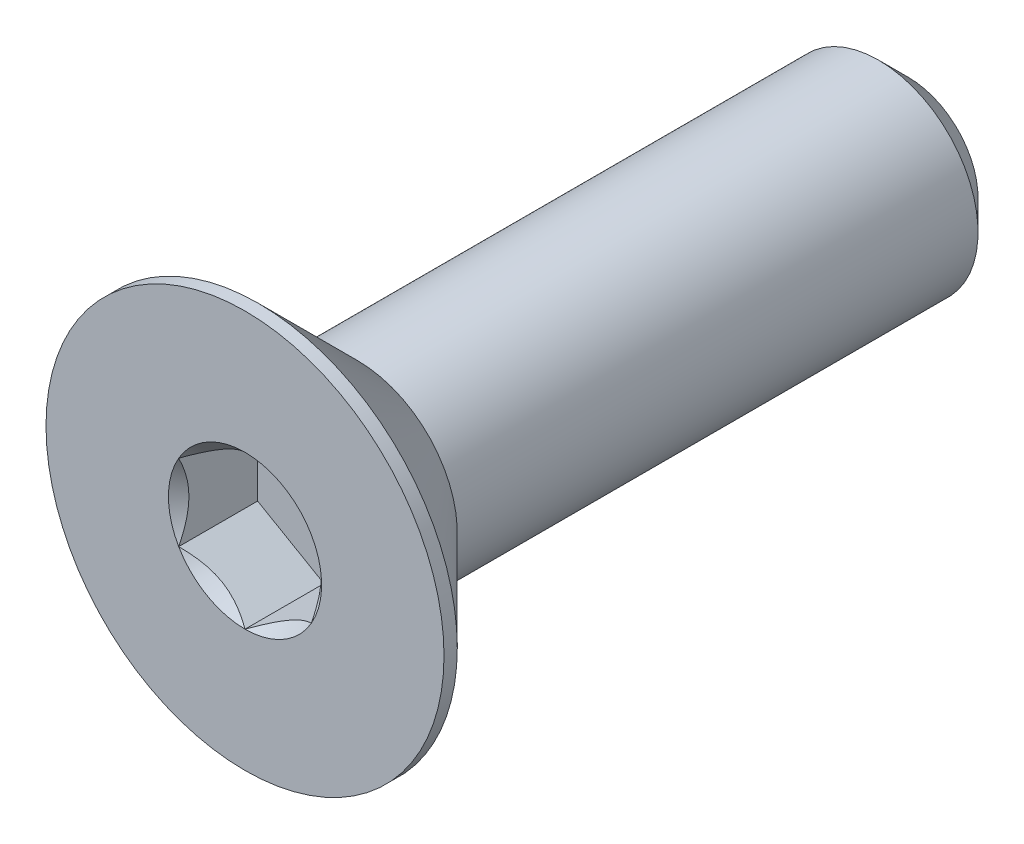
ISO-10303-21;
HEADER;
FILE_DESCRIPTION(('STEP AP214'),'2;1');
FILE_NAME('part.step','',(''),(''),'','','');
FILE_SCHEMA(('AUTOMOTIVE_DESIGN { 1 0 10303 214 1 1 1 1 }'));
ENDSEC;
DATA;
#1=APPLICATION_CONTEXT('core data for automotive mechanical design processes');
#2=APPLICATION_PROTOCOL_DEFINITION('international standard','automotive_design',2000,#1);
#3=PRODUCT_CONTEXT('',#1,'mechanical');
#4=PRODUCT('Part','Part','',(#3));
#5=PRODUCT_RELATED_PRODUCT_CATEGORY('part','',(#4));
#6=PRODUCT_DEFINITION_FORMATION('','',#4);
#7=PRODUCT_DEFINITION_CONTEXT('part definition',#1,'design');
#8=PRODUCT_DEFINITION('design','',#6,#7);
#9=PRODUCT_DEFINITION_SHAPE('','',#8);
#10=(LENGTH_UNIT() NAMED_UNIT(*) SI_UNIT(.MILLI.,.METRE.));
#11=(NAMED_UNIT(*) PLANE_ANGLE_UNIT() SI_UNIT($,.RADIAN.));
#12=(NAMED_UNIT(*) SI_UNIT($,.STERADIAN.) SOLID_ANGLE_UNIT());
#13=UNCERTAINTY_MEASURE_WITH_UNIT(LENGTH_MEASURE(1.E-05),#10,'distance_accuracy_value','');
#14=(GEOMETRIC_REPRESENTATION_CONTEXT(3) GLOBAL_UNCERTAINTY_ASSIGNED_CONTEXT((#13)) GLOBAL_UNIT_ASSIGNED_CONTEXT((#10,
#11,#12)) REPRESENTATION_CONTEXT('',''));
#15=CARTESIAN_POINT('',(0.,0.,0.));
#16=DIRECTION('',(0.,0.,1.));
#17=DIRECTION('',(1.,0.,0.));
#18=AXIS2_PLACEMENT_3D('',#15,#16,#17);
#19=CARTESIAN_POINT('',(0.,0.,-5.));
#20=DIRECTION('',(0.,0.,-1.));
#21=DIRECTION('',(0.,1.,0.));
#22=AXIS2_PLACEMENT_3D('',#19,#20,#21);
#23=CYLINDRICAL_SURFACE('',#22,1.5);
#24=CARTESIAN_POINT('',(0.,0.,3.3));
#25=DIRECTION('',(0.,0.,-1.));
#26=DIRECTION('',(0.,1.,0.));
#27=AXIS2_PLACEMENT_3D('',#24,#25,#26);
#28=CIRCLE('',#27,1.5);
#29=CARTESIAN_POINT('',(0.,1.5,3.3));
#30=VERTEX_POINT('',#29);
#31=EDGE_CURVE('E11',#30,#30,#28,.F.);
#32=ORIENTED_EDGE('',*,*,#31,.F.);
#33=EDGE_LOOP('',(#32));
#34=FACE_BOUND('',#33,.T.);
#35=CARTESIAN_POINT('',(0.,0.,-4.55));
#36=DIRECTION('',(0.,0.,-1.));
#37=DIRECTION('',(0.,1.,0.));
#38=AXIS2_PLACEMENT_3D('',#35,#36,#37);
#39=CIRCLE('',#38,1.5);
#40=CARTESIAN_POINT('',(0.,1.5,-4.55));
#41=VERTEX_POINT('',#40);
#42=EDGE_CURVE('E47',#41,#41,#39,.F.);
#43=ORIENTED_EDGE('',*,*,#42,.T.);
#44=EDGE_LOOP('',(#43));
#45=FACE_BOUND('',#44,.T.);
#46=ADVANCED_FACE('F39',(#34,#45),#23,.T.);
#47=CARTESIAN_POINT('',(0.,1.5,-5.));
#48=DIRECTION('',(0.,0.,-1.));
#49=DIRECTION('',(0.,1.,0.));
#50=AXIS2_PLACEMENT_3D('',#47,#48,#49);
#51=PLANE('',#50);
#52=CARTESIAN_POINT('',(0.,0.,-5.));
#53=DIRECTION('',(0.,0.,-1.));
#54=DIRECTION('',(0.,1.,0.));
#55=AXIS2_PLACEMENT_3D('',#52,#53,#54);
#56=CIRCLE('',#55,1.05);
#57=CARTESIAN_POINT('',(0.,1.05,-5.));
#58=VERTEX_POINT('',#57);
#59=EDGE_CURVE('E151',#58,#58,#56,.T.);
#60=ORIENTED_EDGE('',*,*,#59,.T.);
#61=EDGE_LOOP('',(#60));
#62=FACE_BOUND('',#61,.T.);
#63=ADVANCED_FACE('F160',(#62),#51,.T.);
#64=CARTESIAN_POINT('',(0.,0.,-5.));
#65=DIRECTION('',(0.,0.,1.));
#66=DIRECTION('',(0.,-1.,0.));
#67=AXIS2_PLACEMENT_3D('',#64,#65,#66);
#68=CONICAL_SURFACE('',#67,1.05,0.785398163397449);
#69=ORIENTED_EDGE('',*,*,#42,.F.);
#70=EDGE_LOOP('',(#69));
#71=FACE_BOUND('',#70,.T.);
#72=ORIENTED_EDGE('',*,*,#59,.F.);
#73=EDGE_LOOP('',(#72));
#74=FACE_BOUND('',#73,.T.);
#75=ADVANCED_FACE('F41',(#71,#74),#68,.T.);
#76=CARTESIAN_POINT('',(0.,0.,-5.));
#77=DIRECTION('',(0.,0.,-1.));
#78=DIRECTION('',(0.,1.,0.));
#79=AXIS2_PLACEMENT_3D('',#76,#77,#78);
#80=CYLINDRICAL_SURFACE('',#79,3.);
#81=CARTESIAN_POINT('',(0.,0.,5.));
#82=DIRECTION('',(0.,0.,-1.));
#83=DIRECTION('',(0.,1.,0.));
#84=AXIS2_PLACEMENT_3D('',#81,#82,#83);
#85=CIRCLE('',#84,3.);
#86=CARTESIAN_POINT('',(0.,3.,5.));
#87=VERTEX_POINT('',#86);
#88=EDGE_CURVE('E131',#87,#87,#85,.T.);
#89=ORIENTED_EDGE('',*,*,#88,.T.);
#90=EDGE_LOOP('',(#89));
#91=FACE_BOUND('',#90,.T.);
#92=CARTESIAN_POINT('',(0.,0.,4.8));
#93=DIRECTION('',(0.,0.,-1.));
#94=DIRECTION('',(0.,1.,0.));
#95=AXIS2_PLACEMENT_3D('',#92,#93,#94);
#96=CIRCLE('',#95,3.);
#97=CARTESIAN_POINT('',(0.,3.,4.8));
#98=VERTEX_POINT('',#97);
#99=EDGE_CURVE('E128',#98,#98,#96,.T.);
#100=ORIENTED_EDGE('',*,*,#99,.F.);
#101=EDGE_LOOP('',(#100));
#102=FACE_BOUND('',#101,.T.);
#103=ADVANCED_FACE('F159',(#91,#102),#80,.T.);
#104=CARTESIAN_POINT('',(0.,0.,3.3));
#105=DIRECTION('',(0.,0.,1.));
#106=DIRECTION('',(0.,-1.,0.));
#107=AXIS2_PLACEMENT_3D('',#104,#105,#106);
#108=CONICAL_SURFACE('',#107,1.5,0.78539816339745);
#109=ORIENTED_EDGE('',*,*,#99,.T.);
#110=EDGE_LOOP('',(#109));
#111=FACE_BOUND('',#110,.T.);
#112=ORIENTED_EDGE('',*,*,#31,.T.);
#113=EDGE_LOOP('',(#112));
#114=FACE_BOUND('',#113,.T.);
#115=ADVANCED_FACE('F173',(#111,#114),#108,.T.);
#116=CARTESIAN_POINT('',(0.,0.,5.));
#117=DIRECTION('',(0.,0.,1.));
#118=DIRECTION('',(0.,-1.,0.));
#119=AXIS2_PLACEMENT_3D('',#116,#117,#118);
#120=PLANE('',#119);
#121=CARTESIAN_POINT('',(0.,0.,5.));
#122=DIRECTION('',(0.,0.,1.));
#123=DIRECTION('',(1.,0.,0.));
#124=AXIS2_PLACEMENT_3D('',#121,#122,#123);
#125=CIRCLE('',#124,1.15470053837925);
#126=CARTESIAN_POINT('',(1.,0.577350269189632,5.));
#127=VERTEX_POINT('',#126);
#128=CARTESIAN_POINT('',(0.,1.15470053837926,5.));
#129=VERTEX_POINT('',#128);
#130=EDGE_CURVE('E98',#127,#129,#125,.T.);
#131=ORIENTED_EDGE('',*,*,#130,.F.);
#132=CARTESIAN_POINT('',(0.,0.,5.));
#133=DIRECTION('',(0.,0.,1.));
#134=DIRECTION('',(1.,0.,0.));
#135=AXIS2_PLACEMENT_3D('',#132,#133,#134);
#136=CIRCLE('',#135,1.15470053837925);
#137=CARTESIAN_POINT('',(0.999999999999989,-0.577350269189633,5.));
#138=VERTEX_POINT('',#137);
#139=EDGE_CURVE('E110',#138,#127,#136,.T.);
#140=ORIENTED_EDGE('',*,*,#139,.F.);
#141=CARTESIAN_POINT('',(0.,0.,5.));
#142=DIRECTION('',(0.,0.,1.));
#143=DIRECTION('',(1.,0.,0.));
#144=AXIS2_PLACEMENT_3D('',#141,#142,#143);
#145=CIRCLE('',#144,1.15470053837925);
#146=CARTESIAN_POINT('',(0.,-1.15470053837924,5.));
#147=VERTEX_POINT('',#146);
#148=EDGE_CURVE('E244',#147,#138,#145,.T.);
#149=ORIENTED_EDGE('',*,*,#148,.F.);
#150=CARTESIAN_POINT('',(0.,0.,5.));
#151=DIRECTION('',(0.,0.,1.));
#152=DIRECTION('',(1.,0.,0.));
#153=AXIS2_PLACEMENT_3D('',#150,#151,#152);
#154=CIRCLE('',#153,1.15470053837925);
#155=CARTESIAN_POINT('',(-1.,-0.577350269189614,5.));
#156=VERTEX_POINT('',#155);
#157=EDGE_CURVE('E123',#156,#147,#154,.T.);
#158=ORIENTED_EDGE('',*,*,#157,.F.);
#159=CARTESIAN_POINT('',(0.,0.,5.));
#160=DIRECTION('',(0.,0.,1.));
#161=DIRECTION('',(1.,0.,0.));
#162=AXIS2_PLACEMENT_3D('',#159,#160,#161);
#163=CIRCLE('',#162,1.15470053837925);
#164=CARTESIAN_POINT('',(-1.,0.577350269189624,5.));
#165=VERTEX_POINT('',#164);
#166=EDGE_CURVE('E245',#165,#156,#163,.T.);
#167=ORIENTED_EDGE('',*,*,#166,.F.);
#168=CARTESIAN_POINT('',(0.,0.,5.));
#169=DIRECTION('',(0.,0.,1.));
#170=DIRECTION('',(1.,0.,0.));
#171=AXIS2_PLACEMENT_3D('',#168,#169,#170);
#172=CIRCLE('',#171,1.15470053837925);
#173=EDGE_CURVE('E113',#129,#165,#172,.T.);
#174=ORIENTED_EDGE('',*,*,#173,.F.);
#175=EDGE_LOOP('',(#131,#140,#149,#158,#167,#174));
#176=FACE_BOUND('',#175,.T.);
#177=ORIENTED_EDGE('',*,*,#88,.F.);
#178=EDGE_LOOP('',(#177));
#179=FACE_BOUND('',#178,.T.);
#180=ADVANCED_FACE('F107',(#176,#179),#120,.T.);
#181=CARTESIAN_POINT('',(1.,0.577350269189626,3.81));
#182=DIRECTION('',(0.5,0.866025403784438,0.));
#183=DIRECTION('',(-0.866025403784439,0.5,0.));
#184=AXIS2_PLACEMENT_3D('',#181,#182,#183);
#185=PLANE('',#184);
#186=DIRECTION('',(0.,0.,1.));
#187=VECTOR('',#186,1.);
#188=CARTESIAN_POINT('',(1.,0.577350269189626,3.81));
#189=LINE('',#188,#187);
#190=CARTESIAN_POINT('',(1.,0.577350269189626,3.81));
#191=VERTEX_POINT('',#190);
#192=EDGE_CURVE('E54',#191,#127,#189,.T.);
#193=ORIENTED_EDGE('',*,*,#192,.T.);
#194=CARTESIAN_POINT('',(-0.000199999999999858,1.15481600843309,5.00011548737261));
#195=CARTESIAN_POINT('',(0.0341825950071805,1.13496520795026,4.98027793082573));
#196=CARTESIAN_POINT('',(0.0691401181398244,1.11478247255942,4.96160502063888));
#197=CARTESIAN_POINT('',(0.140422802956089,1.07362739529219,4.92741474272315));
#198=CARTESIAN_POINT('',(0.176754750528983,1.0526511355808,4.91191640902345));
#199=CARTESIAN_POINT('',(0.25001661380331,1.01035337909803,4.88536730714226));
#200=CARTESIAN_POINT('',(0.286927851445413,0.989042666109242,4.87424977399692));
#201=CARTESIAN_POINT('',(0.361562729310857,0.945952199282693,4.85711986577618));
#202=CARTESIAN_POINT('',(0.399284088108633,0.924173762626598,4.85109469746667));
#203=CARTESIAN_POINT('',(0.464292198417931,0.886641312640017,4.84566055496749));
#204=CARTESIAN_POINT('',(0.491494371528169,0.870936130672278,4.84485693831673));
#205=CARTESIAN_POINT('',(0.545846040669109,0.839556179862851,4.84620669941688));
#206=CARTESIAN_POINT('',(0.572995523754872,0.823881418494926,4.84836072954719));
#207=CARTESIAN_POINT('',(0.654056277326956,0.77708097059937,4.85911697212847));
#208=CARTESIAN_POINT('',(0.707564140978423,0.746188191116433,4.87201455641535));
#209=CARTESIAN_POINT('',(0.801476065143427,0.691968116419652,4.90314073060217));
#210=CARTESIAN_POINT('',(0.842320523671831,0.668386557293374,4.91973779770184));
#211=CARTESIAN_POINT('',(0.922409637381942,0.622147085933683,4.95712492468529));
#212=CARTESIAN_POINT('',(0.961659010870436,0.599486449584576,4.9779013418174));
#213=CARTESIAN_POINT('',(1.0002,0.577234799135789,5.00011548737261));
#214=B_SPLINE_CURVE_WITH_KNOTS('',3,(#194,#195,#196,#197,#198,#199,#200,#201,#202,#203,#204,
#205,#206,#207,#208,#209,#210,#211,#212,#213),.UNSPECIFIED.,.F.,.F.,(4,2,2,2,2,2,2,2,2,4),(0.,
0.133237676828558,0.267252229834488,0.399137076269297,0.530689603280765,0.624814864263842,
0.718960890149128,0.907306626112091,1.05710100361789,1.20641411519286),.UNSPECIFIED.);
#215=EDGE_CURVE('E95',#129,#127,#214,.T.);
#216=ORIENTED_EDGE('',*,*,#215,.F.);
#217=DIRECTION('',(0.,0.,1.));
#218=VECTOR('',#217,1.);
#219=CARTESIAN_POINT('',(0.,1.15470053837925,3.81));
#220=LINE('',#219,#218);
#221=CARTESIAN_POINT('',(0.,1.15470053837925,3.81));
#222=VERTEX_POINT('',#221);
#223=EDGE_CURVE('E147',#222,#129,#220,.T.);
#224=ORIENTED_EDGE('',*,*,#223,.F.);
#225=DIRECTION('',(-0.866025403784439,0.5,0.));
#226=VECTOR('',#225,1.);
#227=CARTESIAN_POINT('',(1.,0.577350269189626,3.81));
#228=LINE('',#227,#226);
#229=EDGE_CURVE('E120',#191,#222,#228,.T.);
#230=ORIENTED_EDGE('',*,*,#229,.F.);
#231=EDGE_LOOP('',(#193,#216,#224,#230));
#232=FACE_BOUND('',#231,.T.);
#233=ADVANCED_FACE('F125',(#232),#185,.F.);
#234=CARTESIAN_POINT('',(1.,-0.577350269189627,3.81));
#235=DIRECTION('',(1.,0.,0.));
#236=DIRECTION('',(0.,0.,-1.));
#237=AXIS2_PLACEMENT_3D('',#234,#235,#236);
#238=PLANE('',#237);
#239=DIRECTION('',(0.,0.,1.));
#240=VECTOR('',#239,1.);
#241=CARTESIAN_POINT('',(1.,-0.577350269189627,3.81));
#242=LINE('',#241,#240);
#243=CARTESIAN_POINT('',(1.,-0.577350269189627,3.81));
#244=VERTEX_POINT('',#243);
#245=EDGE_CURVE('E62',#244,#138,#242,.T.);
#246=ORIENTED_EDGE('',*,*,#245,.T.);
#247=CARTESIAN_POINT('',(1.,-1.15147208646462,5.37038567751388));
#248=CARTESIAN_POINT('',(1.,-1.12343447988553,5.34921991987373));
#249=CARTESIAN_POINT('',(1.,-1.09524064850698,5.32826169217592));
#250=CARTESIAN_POINT('',(1.,-1.03847715644377,5.28684602223563));
#251=CARTESIAN_POINT('',(1.,-1.00990740382976,5.26638870612367));
#252=CARTESIAN_POINT('',(1.,-0.923120894333482,5.20560479495452));
#253=CARTESIAN_POINT('',(1.,-0.864253173759064,5.16619222896141));
#254=CARTESIAN_POINT('',(1.,-0.740809858258048,5.08882066420021));
#255=CARTESIAN_POINT('',(1.,-0.676100255137809,5.05107303911435));
#256=CARTESIAN_POINT('',(1.,-0.543448939049125,4.9820245875513));
#257=CARTESIAN_POINT('',(1.,-0.475519112027778,4.95070202784687));
#258=CARTESIAN_POINT('',(1.,-0.373555850333527,4.9123817788838));
#259=CARTESIAN_POINT('',(1.,-0.341031989670906,4.90138359164216));
#260=CARTESIAN_POINT('',(1.,-0.275199079052291,4.88199834214736));
#261=CARTESIAN_POINT('',(1.,-0.24188997517393,4.8736114597767));
#262=CARTESIAN_POINT('',(1.,-0.175247517042989,4.86002522071902));
#263=CARTESIAN_POINT('',(1.,-0.141925568218171,4.85477079076797));
#264=CARTESIAN_POINT('',(1.,-0.0749144362322749,4.84754868657089));
#265=CARTESIAN_POINT('',(1.,-0.0412251978501574,4.84558151361051));
#266=CARTESIAN_POINT('',(1.,0.0249580992634259,4.84508319839316));
#267=CARTESIAN_POINT('',(1.,0.0574512826460445,4.84643026788864));
#268=CARTESIAN_POINT('',(1.,0.122148505701872,4.85221648449899));
#269=CARTESIAN_POINT('',(1.,0.154352610132932,4.85665492066154));
#270=CARTESIAN_POINT('',(1.,0.218799898867646,4.86845683014521));
#271=CARTESIAN_POINT('',(1.,0.25103374326896,4.87587054103851));
#272=CARTESIAN_POINT('',(1.,0.314797132354926,4.89322894249868));
#273=CARTESIAN_POINT('',(1.,0.346326735731012,4.90317342128883));
#274=CARTESIAN_POINT('',(1.,0.445594187730212,4.93822348255434));
#275=CARTESIAN_POINT('',(1.,0.511919139476043,4.96732085835673));
#276=CARTESIAN_POINT('',(1.,0.641453244657538,5.0320153296865));
#277=CARTESIAN_POINT('',(1.,0.70465013312635,5.06763577671524));
#278=CARTESIAN_POINT('',(1.,0.825428490174992,5.14112390134694));
#279=CARTESIAN_POINT('',(1.,0.88313294786769,5.17879194713546));
#280=CARTESIAN_POINT('',(1.,0.96814885370457,5.23702285294316));
#281=CARTESIAN_POINT('',(1.,0.99612057038029,5.25663847576286));
#282=CARTESIAN_POINT('',(1.,1.05168177729902,5.29638851706127));
#283=CARTESIAN_POINT('',(1.,1.07927136997701,5.31652279219883));
#284=CARTESIAN_POINT('',(1.,1.1067018534633,5.33687211907297));
#285=B_SPLINE_CURVE_WITH_KNOTS('',3,(#247,#248,#249,#250,#251,#252,#253,#254,#255,#256,#257,
#258,#259,#260,#261,#262,#263,#264,#265,#266,#267,#268,#269,#270,#271,#272,#273,#274,#275,#276,
#277,#278,#279,#280,#281,#282,#283,#284),.UNSPECIFIED.,.F.,.F.,(4,2,2,2,2,2,2,2,2,2,2,2,2,2,2,2,
2,2,4),(0.,0.105386459083292,0.210799187330128,0.423233611565475,0.647793540908513,
0.871580877738622,0.974493074181434,1.07741235827203,1.17846428203206,1.27953161415764,
1.37694086739612,1.4743277258541,1.57343322804295,1.67253043972853,1.88917353996829,
2.10660791038815,2.31323734249845,2.41572589232046,2.51818641476505),.UNSPECIFIED.);
#286=EDGE_CURVE('E119',#127,#138,#285,.F.);
#287=ORIENTED_EDGE('',*,*,#286,.F.);
#288=ORIENTED_EDGE('',*,*,#192,.F.);
#289=DIRECTION('',(0.,1.,0.));
#290=VECTOR('',#289,1.);
#291=CARTESIAN_POINT('',(1.,-0.577350269189627,3.81));
#292=LINE('',#291,#290);
#293=EDGE_CURVE('E136',#244,#191,#292,.T.);
#294=ORIENTED_EDGE('',*,*,#293,.F.);
#295=EDGE_LOOP('',(#246,#287,#288,#294));
#296=FACE_BOUND('',#295,.T.);
#297=ADVANCED_FACE('F122',(#296),#238,.F.);
#298=CARTESIAN_POINT('',(0.,-1.15470053837925,3.81));
#299=DIRECTION('',(0.5,-0.866025403784439,0.));
#300=DIRECTION('',(0.866025403784439,0.5,0.));
#301=AXIS2_PLACEMENT_3D('',#298,#299,#300);
#302=PLANE('',#301);
#303=DIRECTION('',(0.,0.,1.));
#304=VECTOR('',#303,1.);
#305=CARTESIAN_POINT('',(0.,-1.15470053837925,3.81));
#306=LINE('',#305,#304);
#307=CARTESIAN_POINT('',(0.,-1.15470053837925,3.81));
#308=VERTEX_POINT('',#307);
#309=EDGE_CURVE('E133',#308,#147,#306,.T.);
#310=ORIENTED_EDGE('',*,*,#309,.T.);
#311=CARTESIAN_POINT('',(1.0002,-0.577234799135789,5.00011548737262));
#312=CARTESIAN_POINT('',(0.965817404992819,-0.597085599618622,4.98027793082574));
#313=CARTESIAN_POINT('',(0.930859881860175,-0.617268335009457,4.9616050206389));
#314=CARTESIAN_POINT('',(0.859577197043911,-0.658423412276686,4.92741474272317));
#315=CARTESIAN_POINT('',(0.823245249471016,-0.67939967198808,4.91191640902347));
#316=CARTESIAN_POINT('',(0.74998338619669,-0.721697428470846,4.88536730714227));
#317=CARTESIAN_POINT('',(0.713072148554587,-0.743008141459637,4.87424977399694));
#318=CARTESIAN_POINT('',(0.638437270689143,-0.786098608286186,4.85711986577619));
#319=CARTESIAN_POINT('',(0.600715911891366,-0.80787704494228,4.85109469746668));
#320=CARTESIAN_POINT('',(0.535707801582069,-0.845409494928862,4.8456605549675));
#321=CARTESIAN_POINT('',(0.50850562847183,-0.861114676896601,4.84485693831674));
#322=CARTESIAN_POINT('',(0.45415395933089,-0.892494627706028,4.8462066994169));
#323=CARTESIAN_POINT('',(0.427004476245126,-0.908169389073953,4.84836072954721));
#324=CARTESIAN_POINT('',(0.345943722673041,-0.95496983696951,4.85911697212848));
#325=CARTESIAN_POINT('',(0.292435859021573,-0.985862616452447,4.87201455641537));
#326=CARTESIAN_POINT('',(0.198523934856569,-1.04008269114923,4.90314073060219));
#327=CARTESIAN_POINT('',(0.157679476328166,-1.06366425027551,4.91973779770185));
#328=CARTESIAN_POINT('',(0.0775903626180565,-1.1099037216352,4.9571249246853));
#329=CARTESIAN_POINT('',(0.0383409891295622,-1.1325643579843,4.97790134181741));
#330=CARTESIAN_POINT('',(-0.00020000000000016,-1.15481600843309,5.00011548737263));
#331=B_SPLINE_CURVE_WITH_KNOTS('',3,(#311,#312,#313,#314,#315,#316,#317,#318,#319,#320,#321,
#322,#323,#324,#325,#326,#327,#328,#329,#330),.UNSPECIFIED.,.F.,.F.,(4,2,2,2,2,2,2,2,2,4),(0.,
0.133237676828558,0.267252229834488,0.399137076269297,0.530689603280764,0.624814864263842,
0.71896089014913,0.907306626112095,1.05710100361789,1.20641411519286),.UNSPECIFIED.);
#332=EDGE_CURVE('E242',#138,#147,#331,.T.);
#333=ORIENTED_EDGE('',*,*,#332,.F.);
#334=ORIENTED_EDGE('',*,*,#245,.F.);
#335=DIRECTION('',(0.866025403784439,0.5,0.));
#336=VECTOR('',#335,1.);
#337=CARTESIAN_POINT('',(0.,-1.15470053837925,3.81));
#338=LINE('',#337,#336);
#339=EDGE_CURVE('E234',#308,#244,#338,.T.);
#340=ORIENTED_EDGE('',*,*,#339,.F.);
#341=EDGE_LOOP('',(#310,#333,#334,#340));
#342=FACE_BOUND('',#341,.T.);
#343=ADVANCED_FACE('F199',(#342),#302,.F.);
#344=CARTESIAN_POINT('',(-1.,-0.577350269189626,3.81));
#345=DIRECTION('',(-0.5,-0.866025403784439,0.));
#346=DIRECTION('',(0.866025403784439,-0.5,0.));
#347=AXIS2_PLACEMENT_3D('',#344,#345,#346);
#348=PLANE('',#347);
#349=DIRECTION('',(0.,0.,1.));
#350=VECTOR('',#349,1.);
#351=CARTESIAN_POINT('',(-1.,-0.577350269189626,3.81));
#352=LINE('',#351,#350);
#353=CARTESIAN_POINT('',(-1.,-0.577350269189626,3.81));
#354=VERTEX_POINT('',#353);
#355=EDGE_CURVE('E141',#354,#156,#352,.T.);
#356=ORIENTED_EDGE('',*,*,#355,.T.);
#357=CARTESIAN_POINT('',(0.000199999999999887,-1.15481600843309,5.00011548737263));
#358=CARTESIAN_POINT('',(-0.0341825950071811,-1.13496520795026,4.98027793082574));
#359=CARTESIAN_POINT('',(-0.0691401181398256,-1.11478247255942,4.9616050206389));
#360=CARTESIAN_POINT('',(-0.140422802956091,-1.07362739529219,4.92741474272317));
#361=CARTESIAN_POINT('',(-0.176754750528986,-1.0526511355808,4.91191640902347));
#362=CARTESIAN_POINT('',(-0.250016613803313,-1.01035337909803,4.88536730714228));
#363=CARTESIAN_POINT('',(-0.286927851445417,-0.98904266610924,4.87424977399694));
#364=CARTESIAN_POINT('',(-0.361562729310862,-0.94595219928269,4.85711986577619));
#365=CARTESIAN_POINT('',(-0.399284088108639,-0.924173762626595,4.85109469746668));
#366=CARTESIAN_POINT('',(-0.464292198417937,-0.886641312640012,4.8456605549675));
#367=CARTESIAN_POINT('',(-0.491494371528176,-0.870936130672273,4.84485693831674));
#368=CARTESIAN_POINT('',(-0.545846040669117,-0.839556179862846,4.8462066994169));
#369=CARTESIAN_POINT('',(-0.572995523754881,-0.823881418494921,4.84836072954721));
#370=CARTESIAN_POINT('',(-0.654056277326966,-0.777080970599364,4.85911697212848));
#371=CARTESIAN_POINT('',(-0.707564140978433,-0.746188191116427,4.87201455641537));
#372=CARTESIAN_POINT('',(-0.801476065143437,-0.691968116419646,4.90314073060219));
#373=CARTESIAN_POINT('',(-0.842320523671839,-0.668386557293369,4.91973779770185));
#374=CARTESIAN_POINT('',(-0.922409637381946,-0.62214708593368,4.9571249246853));
#375=CARTESIAN_POINT('',(-0.961659010870439,-0.599486449584574,4.97790134181741));
#376=CARTESIAN_POINT('',(-1.0002,-0.577234799135788,5.00011548737262));
#377=B_SPLINE_CURVE_WITH_KNOTS('',3,(#357,#358,#359,#360,#361,#362,#363,#364,#365,#366,#367,
#368,#369,#370,#371,#372,#373,#374,#375,#376),.UNSPECIFIED.,.F.,.F.,(4,2,2,2,2,2,2,2,2,4),(0.,
0.13323767682856,0.267252229834492,0.399137076269303,0.530689603280773,0.624814864263851,
0.718960890149139,0.907306626112105,1.0571010036179,1.20641411519286),.UNSPECIFIED.);
#378=EDGE_CURVE('E216',#147,#156,#377,.T.);
#379=ORIENTED_EDGE('',*,*,#378,.F.);
#380=ORIENTED_EDGE('',*,*,#309,.F.);
#381=DIRECTION('',(0.866025403784439,-0.5,0.));
#382=VECTOR('',#381,1.);
#383=CARTESIAN_POINT('',(-1.,-0.577350269189626,3.81));
#384=LINE('',#383,#382);
#385=EDGE_CURVE('E232',#354,#308,#384,.T.);
#386=ORIENTED_EDGE('',*,*,#385,.F.);
#387=EDGE_LOOP('',(#356,#379,#380,#386));
#388=FACE_BOUND('',#387,.T.);
#389=ADVANCED_FACE('F195',(#388),#348,.F.);
#390=CARTESIAN_POINT('',(-1.,0.577350269189626,3.81));
#391=DIRECTION('',(-1.,0.,0.));
#392=DIRECTION('',(0.,-1.,0.));
#393=AXIS2_PLACEMENT_3D('',#390,#391,#392);
#394=PLANE('',#393);
#395=DIRECTION('',(0.,0.,1.));
#396=VECTOR('',#395,1.);
#397=CARTESIAN_POINT('',(-1.,0.577350269189626,3.81));
#398=LINE('',#397,#396);
#399=CARTESIAN_POINT('',(-1.,0.577350269189626,3.81));
#400=VERTEX_POINT('',#399);
#401=EDGE_CURVE('E144',#400,#165,#398,.T.);
#402=ORIENTED_EDGE('',*,*,#401,.T.);
#403=CARTESIAN_POINT('',(-1.,-1.15147208646462,5.37038567751387));
#404=CARTESIAN_POINT('',(-1.,-1.12343447988552,5.34921991987372));
#405=CARTESIAN_POINT('',(-1.,-1.09524064850698,5.32826169217592));
#406=CARTESIAN_POINT('',(-1.,-1.03847715644377,5.28684602223563));
#407=CARTESIAN_POINT('',(-1.,-1.00990740382975,5.26638870612367));
#408=CARTESIAN_POINT('',(-1.,-0.92312089433348,5.20560479495452));
#409=CARTESIAN_POINT('',(-1.,-0.864253173759062,5.16619222896141));
#410=CARTESIAN_POINT('',(-1.,-0.740809858258047,5.08882066420021));
#411=CARTESIAN_POINT('',(-1.,-0.676100255137808,5.05107303911435));
#412=CARTESIAN_POINT('',(-1.,-0.543448939049123,4.9820245875513));
#413=CARTESIAN_POINT('',(-1.,-0.475519112027777,4.95070202784687));
#414=CARTESIAN_POINT('',(-1.,-0.373555850333526,4.9123817788838));
#415=CARTESIAN_POINT('',(-1.,-0.341031989670905,4.90138359164216));
#416=CARTESIAN_POINT('',(-1.,-0.27519907905229,4.88199834214736));
#417=CARTESIAN_POINT('',(-1.,-0.241889975173929,4.8736114597767));
#418=CARTESIAN_POINT('',(-1.,-0.175247517042989,4.86002522071902));
#419=CARTESIAN_POINT('',(-1.,-0.141925568218171,4.85477079076797));
#420=CARTESIAN_POINT('',(-1.,-0.0749144362322743,4.84754868657089));
#421=CARTESIAN_POINT('',(-1.,-0.0412251978501569,4.84558151361051));
#422=CARTESIAN_POINT('',(-1.,0.0249580992634261,4.84508319839316));
#423=CARTESIAN_POINT('',(-1.,0.0574512826460446,4.84643026788864));
#424=CARTESIAN_POINT('',(-1.,0.122148505701873,4.85221648449899));
#425=CARTESIAN_POINT('',(-1.,0.154352610132932,4.85665492066154));
#426=CARTESIAN_POINT('',(-1.,0.218799898867646,4.86845683014521));
#427=CARTESIAN_POINT('',(-1.,0.25103374326896,4.87587054103851));
#428=CARTESIAN_POINT('',(-1.,0.314797132354926,4.89322894249868));
#429=CARTESIAN_POINT('',(-1.,0.346326735731012,4.90317342128883));
#430=CARTESIAN_POINT('',(-1.,0.445594187730212,4.93822348255434));
#431=CARTESIAN_POINT('',(-1.,0.511919139476044,4.96732085835673));
#432=CARTESIAN_POINT('',(-1.,0.641453244657539,5.03201532968651));
#433=CARTESIAN_POINT('',(-1.,0.704650133126351,5.06763577671524));
#434=CARTESIAN_POINT('',(-1.,0.825428490174992,5.14112390134694));
#435=CARTESIAN_POINT('',(-1.,0.88313294786769,5.17879194713546));
#436=CARTESIAN_POINT('',(-1.,0.968148853704571,5.23702285294316));
#437=CARTESIAN_POINT('',(-1.,0.996120570380291,5.25663847576286));
#438=CARTESIAN_POINT('',(-1.,1.05168177729902,5.29638851706127));
#439=CARTESIAN_POINT('',(-1.,1.07927136997701,5.31652279219883));
#440=CARTESIAN_POINT('',(-1.,1.1067018534633,5.33687211907297));
#441=B_SPLINE_CURVE_WITH_KNOTS('',3,(#403,#404,#405,#406,#407,#408,#409,#410,#411,#412,#413,
#414,#415,#416,#417,#418,#419,#420,#421,#422,#423,#424,#425,#426,#427,#428,#429,#430,#431,#432,
#433,#434,#435,#436,#437,#438,#439,#440),.UNSPECIFIED.,.F.,.F.,(4,2,2,2,2,2,2,2,2,2,2,2,2,2,2,2,
2,2,4),(0.,0.105386459083292,0.210799187330127,0.423233611565474,0.647793540908512,
0.871580877738622,0.974493074181434,1.07741235827203,1.17846428203206,1.27953161415764,
1.37694086739612,1.47432772585409,1.57343322804295,1.67253043972853,1.88917353996829,
2.10660791038815,2.31323734249845,2.41572589232046,2.51818641476505),.UNSPECIFIED.);
#442=EDGE_CURVE('E101',#156,#165,#441,.T.);
#443=ORIENTED_EDGE('',*,*,#442,.F.);
#444=ORIENTED_EDGE('',*,*,#355,.F.);
#445=DIRECTION('',(0.,-1.,0.));
#446=VECTOR('',#445,1.);
#447=CARTESIAN_POINT('',(-1.,0.577350269189626,3.81));
#448=LINE('',#447,#446);
#449=EDGE_CURVE('E229',#400,#354,#448,.T.);
#450=ORIENTED_EDGE('',*,*,#449,.F.);
#451=EDGE_LOOP('',(#402,#443,#444,#450));
#452=FACE_BOUND('',#451,.T.);
#453=ADVANCED_FACE('F191',(#452),#394,.F.);
#454=CARTESIAN_POINT('',(0.,1.15470053837925,3.81));
#455=DIRECTION('',(-0.5,0.866025403784439,0.));
#456=DIRECTION('',(-0.866025403784439,-0.5,0.));
#457=AXIS2_PLACEMENT_3D('',#454,#455,#456);
#458=PLANE('',#457);
#459=ORIENTED_EDGE('',*,*,#223,.T.);
#460=CARTESIAN_POINT('',(-1.0002,0.577234799135788,5.00011548737261));
#461=CARTESIAN_POINT('',(-0.965817404992819,0.597085599618622,4.98027793082573));
#462=CARTESIAN_POINT('',(-0.930859881860175,0.617268335009457,4.96160502063889));
#463=CARTESIAN_POINT('',(-0.85957719704391,0.658423412276687,4.92741474272316));
#464=CARTESIAN_POINT('',(-0.823245249471015,0.679399671988081,4.91191640902346));
#465=CARTESIAN_POINT('',(-0.749983386196687,0.721697428470848,4.88536730714226));
#466=CARTESIAN_POINT('',(-0.713072148554584,0.743008141459638,4.87424977399692));
#467=CARTESIAN_POINT('',(-0.638437270689138,0.786098608286188,4.85711986577618));
#468=CARTESIAN_POINT('',(-0.600715911891362,0.807877044942283,4.85109469746667));
#469=CARTESIAN_POINT('',(-0.535707801582063,0.845409494928865,4.84566055496749));
#470=CARTESIAN_POINT('',(-0.508505628471825,0.861114676896604,4.84485693831673));
#471=CARTESIAN_POINT('',(-0.454153959330885,0.892494627706031,4.84620669941688));
#472=CARTESIAN_POINT('',(-0.427004476245122,0.908169389073956,4.84836072954719));
#473=CARTESIAN_POINT('',(-0.345943722673038,0.954969836969512,4.85911697212847));
#474=CARTESIAN_POINT('',(-0.292435859021571,0.985862616452448,4.87201455641535));
#475=CARTESIAN_POINT('',(-0.198523934856567,1.04008269114923,4.90314073060217));
#476=CARTESIAN_POINT('',(-0.157679476328165,1.06366425027551,4.91973779770183));
#477=CARTESIAN_POINT('',(-0.0775903626180556,1.1099037216352,4.95712492468529));
#478=CARTESIAN_POINT('',(-0.0383409891295617,1.1325643579843,4.9779013418174));
#479=CARTESIAN_POINT('',(0.000200000000000158,1.15481600843309,5.00011548737261));
#480=B_SPLINE_CURVE_WITH_KNOTS('',3,(#460,#461,#462,#463,#464,#465,#466,#467,#468,#469,#470,
#471,#472,#473,#474,#475,#476,#477,#478,#479),.UNSPECIFIED.,.F.,.F.,(4,2,2,2,2,2,2,2,2,4),(0.,
0.13323767682856,0.267252229834492,0.399137076269303,0.530689603280772,0.62481486426385,
0.718960890149136,0.9073066261121,1.0571010036179,1.20641411519286),.UNSPECIFIED.);
#481=EDGE_CURVE('E238',#165,#129,#480,.T.);
#482=ORIENTED_EDGE('',*,*,#481,.F.);
#483=ORIENTED_EDGE('',*,*,#401,.F.);
#484=DIRECTION('',(-0.866025403784439,-0.5,0.));
#485=VECTOR('',#484,1.);
#486=CARTESIAN_POINT('',(0.,1.15470053837925,3.81));
#487=LINE('',#486,#485);
#488=EDGE_CURVE('E226',#222,#400,#487,.T.);
#489=ORIENTED_EDGE('',*,*,#488,.F.);
#490=EDGE_LOOP('',(#459,#482,#483,#489));
#491=FACE_BOUND('',#490,.T.);
#492=ADVANCED_FACE('F187',(#491),#458,.F.);
#493=CARTESIAN_POINT('',(0.,0.,3.81));
#494=DIRECTION('',(0.,0.,1.));
#495=DIRECTION('',(1.,0.,0.));
#496=AXIS2_PLACEMENT_3D('',#493,#494,#495);
#497=PLANE('',#496);
#498=ORIENTED_EDGE('',*,*,#229,.T.);
#499=ORIENTED_EDGE('',*,*,#488,.T.);
#500=ORIENTED_EDGE('',*,*,#449,.T.);
#501=ORIENTED_EDGE('',*,*,#385,.T.);
#502=ORIENTED_EDGE('',*,*,#339,.T.);
#503=ORIENTED_EDGE('',*,*,#293,.T.);
#504=EDGE_LOOP('',(#498,#499,#500,#501,#502,#503));
#505=FACE_BOUND('',#504,.T.);
#506=ADVANCED_FACE('F190',(#505),#497,.T.);
#507=CARTESIAN_POINT('',(0.,0.,5.));
#508=DIRECTION('',(0.,0.,1.));
#509=DIRECTION('',(1.,0.,0.));
#510=AXIS2_PLACEMENT_3D('',#507,#508,#509);
#511=CONICAL_SURFACE('',#510,1.15470053837925,0.78539816339745);
#512=ORIENTED_EDGE('',*,*,#481,.T.);
#513=ORIENTED_EDGE('',*,*,#173,.T.);
#514=EDGE_LOOP('',(#512,#513));
#515=FACE_BOUND('',#514,.T.);
#516=ADVANCED_FACE('F206',(#515),#511,.F.);
#517=CARTESIAN_POINT('',(0.,0.,5.));
#518=DIRECTION('',(0.,0.,1.));
#519=DIRECTION('',(1.,0.,0.));
#520=AXIS2_PLACEMENT_3D('',#517,#518,#519);
#521=CONICAL_SURFACE('',#520,1.15470053837925,0.78539816339745);
#522=ORIENTED_EDGE('',*,*,#378,.T.);
#523=ORIENTED_EDGE('',*,*,#157,.T.);
#524=EDGE_LOOP('',(#522,#523));
#525=FACE_BOUND('',#524,.T.);
#526=ADVANCED_FACE('F208',(#525),#521,.F.);
#527=CARTESIAN_POINT('',(0.,0.,5.));
#528=DIRECTION('',(0.,0.,1.));
#529=DIRECTION('',(1.,0.,0.));
#530=AXIS2_PLACEMENT_3D('',#527,#528,#529);
#531=CONICAL_SURFACE('',#530,1.15470053837925,0.78539816339745);
#532=ORIENTED_EDGE('',*,*,#286,.T.);
#533=ORIENTED_EDGE('',*,*,#139,.T.);
#534=EDGE_LOOP('',(#532,#533));
#535=FACE_BOUND('',#534,.T.);
#536=ADVANCED_FACE('F118',(#535),#531,.F.);
#537=CARTESIAN_POINT('',(0.,0.,5.));
#538=DIRECTION('',(0.,0.,1.));
#539=DIRECTION('',(1.,0.,0.));
#540=AXIS2_PLACEMENT_3D('',#537,#538,#539);
#541=CONICAL_SURFACE('',#540,1.15470053837925,0.78539816339745);
#542=ORIENTED_EDGE('',*,*,#332,.T.);
#543=ORIENTED_EDGE('',*,*,#148,.T.);
#544=EDGE_LOOP('',(#542,#543));
#545=FACE_BOUND('',#544,.T.);
#546=ADVANCED_FACE('F257',(#545),#541,.F.);
#547=CARTESIAN_POINT('',(0.,0.,5.));
#548=DIRECTION('',(0.,0.,1.));
#549=DIRECTION('',(1.,0.,0.));
#550=AXIS2_PLACEMENT_3D('',#547,#548,#549);
#551=CONICAL_SURFACE('',#550,1.15470053837925,0.78539816339745);
#552=ORIENTED_EDGE('',*,*,#442,.T.);
#553=ORIENTED_EDGE('',*,*,#166,.T.);
#554=EDGE_LOOP('',(#552,#553));
#555=FACE_BOUND('',#554,.T.);
#556=ADVANCED_FACE('F262',(#555),#551,.F.);
#557=CARTESIAN_POINT('',(0.,0.,5.));
#558=DIRECTION('',(0.,0.,1.));
#559=DIRECTION('',(1.,0.,0.));
#560=AXIS2_PLACEMENT_3D('',#557,#558,#559);
#561=CONICAL_SURFACE('',#560,1.15470053837925,0.78539816339745);
#562=ORIENTED_EDGE('',*,*,#215,.T.);
#563=ORIENTED_EDGE('',*,*,#130,.T.);
#564=EDGE_LOOP('',(#562,#563));
#565=FACE_BOUND('',#564,.T.);
#566=ADVANCED_FACE('F97',(#565),#561,.F.);
#567=CLOSED_SHELL('',(#46,#63,#75,#103,#115,#180,#233,#297,#343,#389,#453,#492,#506,#516,#526,
#536,#546,#556,#566));
#568=MANIFOLD_SOLID_BREP('B2',#567);
#569=ADVANCED_BREP_SHAPE_REPRESENTATION('',(#18,#568),#14);
#570=SHAPE_DEFINITION_REPRESENTATION(#9,#569);
ENDSEC;
END-ISO-10303-21;
